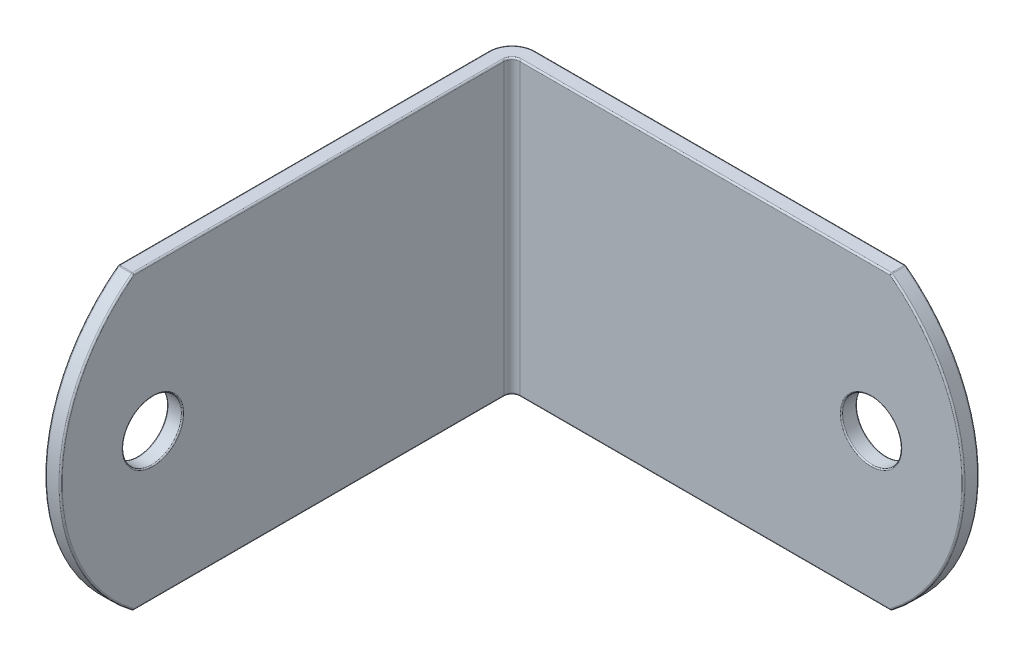
ISO-10303-21;
HEADER;
FILE_DESCRIPTION(('STEP AP214'),'2;1');
FILE_NAME('part.step','',(''),(''),'','','');
FILE_SCHEMA(('AUTOMOTIVE_DESIGN { 1 0 10303 214 1 1 1 1 }'));
ENDSEC;
DATA;
#1=APPLICATION_CONTEXT('core data for automotive mechanical design processes');
#2=APPLICATION_PROTOCOL_DEFINITION('international standard','automotive_design',2000,#1);
#3=PRODUCT_CONTEXT('',#1,'mechanical');
#4=PRODUCT('Part','Part','',(#3));
#5=PRODUCT_RELATED_PRODUCT_CATEGORY('part','',(#4));
#6=PRODUCT_DEFINITION_FORMATION('','',#4);
#7=PRODUCT_DEFINITION_CONTEXT('part definition',#1,'design');
#8=PRODUCT_DEFINITION('design','',#6,#7);
#9=PRODUCT_DEFINITION_SHAPE('','',#8);
#10=(LENGTH_UNIT() NAMED_UNIT(*) SI_UNIT(.MILLI.,.METRE.));
#11=(NAMED_UNIT(*) PLANE_ANGLE_UNIT() SI_UNIT($,.RADIAN.));
#12=(NAMED_UNIT(*) SI_UNIT($,.STERADIAN.) SOLID_ANGLE_UNIT());
#13=UNCERTAINTY_MEASURE_WITH_UNIT(LENGTH_MEASURE(1.E-05),#10,'distance_accuracy_value','');
#14=(GEOMETRIC_REPRESENTATION_CONTEXT(3) GLOBAL_UNCERTAINTY_ASSIGNED_CONTEXT((#13)) GLOBAL_UNIT_ASSIGNED_CONTEXT((#10,
#11,#12)) REPRESENTATION_CONTEXT('',''));
#15=CARTESIAN_POINT('',(0.,0.,0.));
#16=DIRECTION('',(0.,0.,1.));
#17=DIRECTION('',(1.,0.,0.));
#18=AXIS2_PLACEMENT_3D('',#15,#16,#17);
#19=CARTESIAN_POINT('',(-17.145,-11.90625,-19.05));
#20=DIRECTION('',(0.,0.,-1.));
#21=DIRECTION('',(-1.,0.,0.));
#22=AXIS2_PLACEMENT_3D('',#19,#20,#21);
#23=PLANE('',#22);
#24=CARTESIAN_POINT('',(11.509375,0.,-19.05));
#25=DIRECTION('',(0.,0.,-1.));
#26=DIRECTION('',(-1.,0.,0.));
#27=AXIS2_PLACEMENT_3D('',#24,#25,#26);
#28=CIRCLE('',#27,2.50952);
#29=CARTESIAN_POINT('',(8.999855,0.,-19.05));
#30=VERTEX_POINT('',#29);
#31=EDGE_CURVE('E374',#30,#30,#28,.F.);
#32=ORIENTED_EDGE('',*,*,#31,.T.);
#33=EDGE_LOOP('',(#32));
#34=FACE_BOUND('',#33,.T.);
#35=CARTESIAN_POINT('',(4.1671875,0.,-19.05));
#36=DIRECTION('',(0.,0.,-1.));
#37=DIRECTION('',(-1.,0.,0.));
#38=AXIS2_PLACEMENT_3D('',#35,#36,#37);
#39=CIRCLE('',#38,14.7558125);
#40=CARTESIAN_POINT('',(13.0544408424369,11.77925,-19.05));
#41=VERTEX_POINT('',#40);
#42=CARTESIAN_POINT('',(13.0544408424369,-11.77925,-19.05));
#43=VERTEX_POINT('',#42);
#44=EDGE_CURVE('E273',#41,#43,#39,.T.);
#45=ORIENTED_EDGE('',*,*,#44,.T.);
#46=DIRECTION('',(-1.,0.,0.));
#47=VECTOR('',#46,1.);
#48=CARTESIAN_POINT('',(-17.145,-11.77925,-19.05));
#49=LINE('',#48,#47);
#50=CARTESIAN_POINT('',(-17.145,-11.77925,-19.05));
#51=VERTEX_POINT('',#50);
#52=EDGE_CURVE('E277',#43,#51,#49,.T.);
#53=ORIENTED_EDGE('',*,*,#52,.T.);
#54=DIRECTION('',(0.,1.,0.));
#55=VECTOR('',#54,1.);
#56=CARTESIAN_POINT('',(-17.145,-11.90625,-19.05));
#57=LINE('',#56,#55);
#58=CARTESIAN_POINT('',(-17.145,11.77925,-19.05));
#59=VERTEX_POINT('',#58);
#60=EDGE_CURVE('E178',#51,#59,#57,.T.);
#61=ORIENTED_EDGE('',*,*,#60,.T.);
#62=DIRECTION('',(-1.,0.,0.));
#63=VECTOR('',#62,1.);
#64=CARTESIAN_POINT('',(-17.145,11.77925,-19.05));
#65=LINE('',#64,#63);
#66=EDGE_CURVE('E275',#59,#41,#65,.F.);
#67=ORIENTED_EDGE('',*,*,#66,.T.);
#68=EDGE_LOOP('',(#45,#53,#61,#67));
#69=FACE_BOUND('',#68,.T.);
#70=ADVANCED_FACE('F34',(#34,#69),#23,.T.);
#71=CARTESIAN_POINT('',(-17.145,-11.90625,-17.78));
#72=DIRECTION('',(0.,0.,1.));
#73=DIRECTION('',(1.,0.,0.));
#74=AXIS2_PLACEMENT_3D('',#71,#72,#73);
#75=PLANE('',#74);
#76=CARTESIAN_POINT('',(11.509375,0.,-17.78));
#77=DIRECTION('',(0.,0.,1.));
#78=DIRECTION('',(1.,0.,0.));
#79=AXIS2_PLACEMENT_3D('',#76,#77,#78);
#80=CIRCLE('',#79,2.50952);
#81=CARTESIAN_POINT('',(14.018895,0.,-17.78));
#82=VERTEX_POINT('',#81);
#83=EDGE_CURVE('E42',#82,#82,#80,.F.);
#84=ORIENTED_EDGE('',*,*,#83,.T.);
#85=EDGE_LOOP('',(#84));
#86=FACE_BOUND('',#85,.T.);
#87=DIRECTION('',(0.,1.,0.));
#88=VECTOR('',#87,1.);
#89=CARTESIAN_POINT('',(-17.145,-11.90625,-17.78));
#90=LINE('',#89,#88);
#91=CARTESIAN_POINT('',(-17.145,-11.77925,-17.78));
#92=VERTEX_POINT('',#91);
#93=CARTESIAN_POINT('',(-17.145,11.77925,-17.78));
#94=VERTEX_POINT('',#93);
#95=EDGE_CURVE('E618',#92,#94,#90,.T.);
#96=ORIENTED_EDGE('',*,*,#95,.F.);
#97=DIRECTION('',(1.,0.,0.));
#98=VECTOR('',#97,1.);
#99=CARTESIAN_POINT('',(13.096875,-11.77925,-17.78));
#100=LINE('',#99,#98);
#101=CARTESIAN_POINT('',(13.0544408424369,-11.77925,-17.78));
#102=VERTEX_POINT('',#101);
#103=EDGE_CURVE('E248',#92,#102,#100,.T.);
#104=ORIENTED_EDGE('',*,*,#103,.T.);
#105=CARTESIAN_POINT('',(4.1671875,0.,-17.78));
#106=DIRECTION('',(0.,0.,1.));
#107=DIRECTION('',(1.,0.,0.));
#108=AXIS2_PLACEMENT_3D('',#105,#106,#107);
#109=CIRCLE('',#108,14.7558125);
#110=CARTESIAN_POINT('',(13.0544408424369,11.77925,-17.78));
#111=VERTEX_POINT('',#110);
#112=EDGE_CURVE('E244',#102,#111,#109,.T.);
#113=ORIENTED_EDGE('',*,*,#112,.T.);
#114=DIRECTION('',(1.,0.,0.));
#115=VECTOR('',#114,1.);
#116=CARTESIAN_POINT('',(-17.145,11.77925,-17.78));
#117=LINE('',#116,#115);
#118=EDGE_CURVE('E246',#111,#94,#117,.F.);
#119=ORIENTED_EDGE('',*,*,#118,.T.);
#120=EDGE_LOOP('',(#96,#104,#113,#119));
#121=FACE_BOUND('',#120,.T.);
#122=ADVANCED_FACE('F388',(#86,#121),#75,.T.);
#123=CARTESIAN_POINT('',(-19.05,-11.90625,19.05));
#124=DIRECTION('',(-1.,0.,0.));
#125=DIRECTION('',(0.,0.,1.));
#126=AXIS2_PLACEMENT_3D('',#123,#124,#125);
#127=PLANE('',#126);
#128=CARTESIAN_POINT('',(-19.05,0.,11.509375));
#129=DIRECTION('',(-1.,0.,0.));
#130=DIRECTION('',(0.,0.,1.));
#131=AXIS2_PLACEMENT_3D('',#128,#129,#130);
#132=CIRCLE('',#131,2.50952);
#133=CARTESIAN_POINT('',(-19.05,0.,14.018895));
#134=VERTEX_POINT('',#133);
#135=EDGE_CURVE('E383',#134,#134,#132,.F.);
#136=ORIENTED_EDGE('',*,*,#135,.T.);
#137=EDGE_LOOP('',(#136));
#138=FACE_BOUND('',#137,.T.);
#139=DIRECTION('',(0.,1.,0.));
#140=VECTOR('',#139,1.);
#141=CARTESIAN_POINT('',(-19.05,-11.90625,-17.145));
#142=LINE('',#141,#140);
#143=CARTESIAN_POINT('',(-19.05,-11.77925,-17.145));
#144=VERTEX_POINT('',#143);
#145=CARTESIAN_POINT('',(-19.05,11.77925,-17.145));
#146=VERTEX_POINT('',#145);
#147=EDGE_CURVE('E175',#144,#146,#142,.T.);
#148=ORIENTED_EDGE('',*,*,#147,.F.);
#149=DIRECTION('',(0.,0.,1.));
#150=VECTOR('',#149,1.);
#151=CARTESIAN_POINT('',(-19.05,-11.77925,13.096875));
#152=LINE('',#151,#150);
#153=CARTESIAN_POINT('',(-19.05,-11.77925,13.0544408424369));
#154=VERTEX_POINT('',#153);
#155=EDGE_CURVE('E190',#144,#154,#152,.T.);
#156=ORIENTED_EDGE('',*,*,#155,.T.);
#157=CARTESIAN_POINT('',(-19.05,0.,4.1671875));
#158=DIRECTION('',(-1.,0.,0.));
#159=DIRECTION('',(0.,0.,1.));
#160=AXIS2_PLACEMENT_3D('',#157,#158,#159);
#161=CIRCLE('',#160,14.7558125);
#162=CARTESIAN_POINT('',(-19.05,11.77925,13.0544408424369));
#163=VERTEX_POINT('',#162);
#164=EDGE_CURVE('E193',#154,#163,#161,.T.);
#165=ORIENTED_EDGE('',*,*,#164,.T.);
#166=DIRECTION('',(0.,0.,1.));
#167=VECTOR('',#166,1.);
#168=CARTESIAN_POINT('',(-19.05,11.77925,19.05));
#169=LINE('',#168,#167);
#170=EDGE_CURVE('E192',#163,#146,#169,.F.);
#171=ORIENTED_EDGE('',*,*,#170,.T.);
#172=EDGE_LOOP('',(#148,#156,#165,#171));
#173=FACE_BOUND('',#172,.T.);
#174=ADVANCED_FACE('F188',(#138,#173),#127,.T.);
#175=CARTESIAN_POINT('',(-17.78,-11.90625,19.05));
#176=DIRECTION('',(1.,0.,0.));
#177=DIRECTION('',(0.,0.,-1.));
#178=AXIS2_PLACEMENT_3D('',#175,#176,#177);
#179=PLANE('',#178);
#180=CARTESIAN_POINT('',(-17.78,0.,11.509375));
#181=DIRECTION('',(1.,0.,0.));
#182=DIRECTION('',(0.,0.,-1.));
#183=AXIS2_PLACEMENT_3D('',#180,#181,#182);
#184=CIRCLE('',#183,2.50952);
#185=CARTESIAN_POINT('',(-17.78,0.,8.999855));
#186=VERTEX_POINT('',#185);
#187=EDGE_CURVE('E12',#186,#186,#184,.F.);
#188=ORIENTED_EDGE('',*,*,#187,.T.);
#189=EDGE_LOOP('',(#188));
#190=FACE_BOUND('',#189,.T.);
#191=CARTESIAN_POINT('',(-17.78,0.,4.1671875));
#192=DIRECTION('',(1.,0.,0.));
#193=DIRECTION('',(0.,0.,-1.));
#194=AXIS2_PLACEMENT_3D('',#191,#192,#193);
#195=CIRCLE('',#194,14.7558125);
#196=CARTESIAN_POINT('',(-17.78,11.77925,13.0544408424369));
#197=VERTEX_POINT('',#196);
#198=CARTESIAN_POINT('',(-17.78,-11.77925,13.0544408424369));
#199=VERTEX_POINT('',#198);
#200=EDGE_CURVE('E49',#197,#199,#195,.T.);
#201=ORIENTED_EDGE('',*,*,#200,.T.);
#202=DIRECTION('',(0.,0.,-1.));
#203=VECTOR('',#202,1.);
#204=CARTESIAN_POINT('',(-17.78,-11.77925,-17.145));
#205=LINE('',#204,#203);
#206=CARTESIAN_POINT('',(-17.78,-11.77925,-17.145));
#207=VERTEX_POINT('',#206);
#208=EDGE_CURVE('E281',#199,#207,#205,.T.);
#209=ORIENTED_EDGE('',*,*,#208,.T.);
#210=DIRECTION('',(0.,1.,0.));
#211=VECTOR('',#210,1.);
#212=CARTESIAN_POINT('',(-17.78,-11.90625,-17.145));
#213=LINE('',#212,#211);
#214=CARTESIAN_POINT('',(-17.78,11.77925,-17.145));
#215=VERTEX_POINT('',#214);
#216=EDGE_CURVE('E368',#207,#215,#213,.T.);
#217=ORIENTED_EDGE('',*,*,#216,.T.);
#218=DIRECTION('',(0.,0.,-1.));
#219=VECTOR('',#218,1.);
#220=CARTESIAN_POINT('',(-17.78,11.77925,19.05));
#221=LINE('',#220,#219);
#222=EDGE_CURVE('E54',#215,#197,#221,.F.);
#223=ORIENTED_EDGE('',*,*,#222,.T.);
#224=EDGE_LOOP('',(#201,#209,#217,#223));
#225=FACE_BOUND('',#224,.T.);
#226=ADVANCED_FACE('F420',(#190,#225),#179,.T.);
#227=CARTESIAN_POINT('',(-17.145,-11.90625,-17.145));
#228=DIRECTION('',(0.,1.,0.));
#229=DIRECTION('',(0.,0.,1.));
#230=AXIS2_PLACEMENT_3D('',#227,#228,#229);
#231=PLANE('',#230);
#232=CARTESIAN_POINT('',(-17.145,-11.90625,-17.145));
#233=DIRECTION('',(0.,1.,0.));
#234=DIRECTION('',(0.,0.,1.));
#235=AXIS2_PLACEMENT_3D('',#232,#233,#234);
#236=CIRCLE('',#235,1.778);
#237=CARTESIAN_POINT('',(-18.923,-11.90625,-17.145));
#238=VERTEX_POINT('',#237);
#239=CARTESIAN_POINT('',(-17.145,-11.90625,-18.923));
#240=VERTEX_POINT('',#239);
#241=EDGE_CURVE('E198',#238,#240,#236,.F.);
#242=ORIENTED_EDGE('',*,*,#241,.T.);
#243=DIRECTION('',(-1.,0.,0.));
#244=VECTOR('',#243,1.);
#245=CARTESIAN_POINT('',(13.096875,-11.90625,-18.923));
#246=LINE('',#245,#244);
#247=CARTESIAN_POINT('',(13.0544408424369,-11.90625,-18.923));
#248=VERTEX_POINT('',#247);
#249=EDGE_CURVE('E225',#240,#248,#246,.F.);
#250=ORIENTED_EDGE('',*,*,#249,.T.);
#251=DIRECTION('',(0.,0.,1.));
#252=VECTOR('',#251,1.);
#253=CARTESIAN_POINT('',(13.0544408424369,-11.90625,-17.145));
#254=LINE('',#253,#252);
#255=CARTESIAN_POINT('',(13.0544408424369,-11.90625,-17.907));
#256=VERTEX_POINT('',#255);
#257=EDGE_CURVE('E222',#248,#256,#254,.T.);
#258=ORIENTED_EDGE('',*,*,#257,.T.);
#259=DIRECTION('',(1.,0.,0.));
#260=VECTOR('',#259,1.);
#261=CARTESIAN_POINT('',(-17.145,-11.90625,-17.907));
#262=LINE('',#261,#260);
#263=CARTESIAN_POINT('',(-17.145,-11.90625,-17.907));
#264=VERTEX_POINT('',#263);
#265=EDGE_CURVE('E218',#256,#264,#262,.F.);
#266=ORIENTED_EDGE('',*,*,#265,.T.);
#267=CARTESIAN_POINT('',(-17.145,-11.90625,-17.145));
#268=DIRECTION('',(0.,1.,0.));
#269=DIRECTION('',(0.,0.,1.));
#270=AXIS2_PLACEMENT_3D('',#267,#268,#269);
#271=CIRCLE('',#270,0.762);
#272=CARTESIAN_POINT('',(-17.907,-11.90625,-17.145));
#273=VERTEX_POINT('',#272);
#274=EDGE_CURVE('E216',#264,#273,#271,.T.);
#275=ORIENTED_EDGE('',*,*,#274,.T.);
#276=DIRECTION('',(0.,0.,-1.));
#277=VECTOR('',#276,1.);
#278=CARTESIAN_POINT('',(-17.907,-11.90625,13.096875));
#279=LINE('',#278,#277);
#280=CARTESIAN_POINT('',(-17.907,-11.90625,13.0544408424369));
#281=VERTEX_POINT('',#280);
#282=EDGE_CURVE('E208',#273,#281,#279,.F.);
#283=ORIENTED_EDGE('',*,*,#282,.T.);
#284=DIRECTION('',(-1.,0.,0.));
#285=VECTOR('',#284,1.);
#286=CARTESIAN_POINT('',(-19.05,-11.90625,13.0544408424369));
#287=LINE('',#286,#285);
#288=CARTESIAN_POINT('',(-18.923,-11.90625,13.0544408424369));
#289=VERTEX_POINT('',#288);
#290=EDGE_CURVE('E210',#281,#289,#287,.T.);
#291=ORIENTED_EDGE('',*,*,#290,.T.);
#292=DIRECTION('',(0.,0.,1.));
#293=VECTOR('',#292,1.);
#294=CARTESIAN_POINT('',(-18.923,-11.90625,-17.145));
#295=LINE('',#294,#293);
#296=EDGE_CURVE('E220',#289,#238,#295,.F.);
#297=ORIENTED_EDGE('',*,*,#296,.T.);
#298=EDGE_LOOP('',(#242,#250,#258,#266,#275,#283,#291,#297));
#299=FACE_BOUND('',#298,.T.);
#300=ADVANCED_FACE('F423',(#299),#231,.F.);
#301=CARTESIAN_POINT('',(-17.145,11.90625,-17.145));
#302=DIRECTION('',(0.,1.,0.));
#303=DIRECTION('',(0.,0.,1.));
#304=AXIS2_PLACEMENT_3D('',#301,#302,#303);
#305=PLANE('',#304);
#306=DIRECTION('',(0.,0.,-1.));
#307=VECTOR('',#306,1.);
#308=CARTESIAN_POINT('',(13.0544408424369,11.90625,-19.05));
#309=LINE('',#308,#307);
#310=CARTESIAN_POINT('',(13.0544408424369,11.90625,-17.907));
#311=VERTEX_POINT('',#310);
#312=CARTESIAN_POINT('',(13.0544408424369,11.90625,-18.923));
#313=VERTEX_POINT('',#312);
#314=EDGE_CURVE('E238',#311,#313,#309,.T.);
#315=ORIENTED_EDGE('',*,*,#314,.T.);
#316=DIRECTION('',(-1.,0.,0.));
#317=VECTOR('',#316,1.);
#318=CARTESIAN_POINT('',(-17.145,11.90625,-18.923));
#319=LINE('',#318,#317);
#320=CARTESIAN_POINT('',(-17.145,11.90625,-18.923));
#321=VERTEX_POINT('',#320);
#322=EDGE_CURVE('E242',#313,#321,#319,.T.);
#323=ORIENTED_EDGE('',*,*,#322,.T.);
#324=CARTESIAN_POINT('',(-17.145,11.90625,-17.145));
#325=DIRECTION('',(0.,1.,0.));
#326=DIRECTION('',(0.,0.,1.));
#327=AXIS2_PLACEMENT_3D('',#324,#325,#326);
#328=CIRCLE('',#327,1.778);
#329=CARTESIAN_POINT('',(-18.923,11.90625,-17.145));
#330=VERTEX_POINT('',#329);
#331=EDGE_CURVE('E240',#321,#330,#328,.T.);
#332=ORIENTED_EDGE('',*,*,#331,.T.);
#333=DIRECTION('',(0.,0.,1.));
#334=VECTOR('',#333,1.);
#335=CARTESIAN_POINT('',(-18.923,11.90625,-17.145));
#336=LINE('',#335,#334);
#337=CARTESIAN_POINT('',(-18.923,11.90625,13.0544408424369));
#338=VERTEX_POINT('',#337);
#339=EDGE_CURVE('E235',#330,#338,#336,.T.);
#340=ORIENTED_EDGE('',*,*,#339,.T.);
#341=DIRECTION('',(1.,0.,0.));
#342=VECTOR('',#341,1.);
#343=CARTESIAN_POINT('',(-17.145,11.90625,13.0544408424369));
#344=LINE('',#343,#342);
#345=CARTESIAN_POINT('',(-17.907,11.90625,13.0544408424369));
#346=VERTEX_POINT('',#345);
#347=EDGE_CURVE('E229',#338,#346,#344,.T.);
#348=ORIENTED_EDGE('',*,*,#347,.T.);
#349=DIRECTION('',(0.,0.,-1.));
#350=VECTOR('',#349,1.);
#351=CARTESIAN_POINT('',(-17.907,11.90625,-17.145));
#352=LINE('',#351,#350);
#353=CARTESIAN_POINT('',(-17.907,11.90625,-17.145));
#354=VERTEX_POINT('',#353);
#355=EDGE_CURVE('E183',#346,#354,#352,.T.);
#356=ORIENTED_EDGE('',*,*,#355,.T.);
#357=CARTESIAN_POINT('',(-17.145,11.90625,-17.145));
#358=DIRECTION('',(0.,1.,0.));
#359=DIRECTION('',(0.,0.,1.));
#360=AXIS2_PLACEMENT_3D('',#357,#358,#359);
#361=CIRCLE('',#360,0.762);
#362=CARTESIAN_POINT('',(-17.145,11.90625,-17.907));
#363=VERTEX_POINT('',#362);
#364=EDGE_CURVE('E231',#354,#363,#361,.F.);
#365=ORIENTED_EDGE('',*,*,#364,.T.);
#366=DIRECTION('',(1.,0.,0.));
#367=VECTOR('',#366,1.);
#368=CARTESIAN_POINT('',(-17.145,11.90625,-17.907));
#369=LINE('',#368,#367);
#370=EDGE_CURVE('E233',#363,#311,#369,.T.);
#371=ORIENTED_EDGE('',*,*,#370,.T.);
#372=EDGE_LOOP('',(#315,#323,#332,#340,#348,#356,#365,#371));
#373=FACE_BOUND('',#372,.T.);
#374=ADVANCED_FACE('F561',(#373),#305,.T.);
#375=CARTESIAN_POINT('',(-17.145,-11.90625,-17.145));
#376=DIRECTION('',(0.,1.,0.));
#377=DIRECTION('',(0.,0.,1.));
#378=AXIS2_PLACEMENT_3D('',#375,#376,#377);
#379=CYLINDRICAL_SURFACE('',#378,1.905);
#380=ORIENTED_EDGE('',*,*,#60,.F.);
#381=CARTESIAN_POINT('',(-17.145,-11.77925,-17.145));
#382=DIRECTION('',(0.,1.,0.));
#383=DIRECTION('',(0.,0.,1.));
#384=AXIS2_PLACEMENT_3D('',#381,#382,#383);
#385=CIRCLE('',#384,1.905);
#386=EDGE_CURVE('E172',#51,#144,#385,.T.);
#387=ORIENTED_EDGE('',*,*,#386,.T.);
#388=ORIENTED_EDGE('',*,*,#147,.T.);
#389=CARTESIAN_POINT('',(-17.145,11.77925,-17.145));
#390=DIRECTION('',(0.,1.,0.));
#391=DIRECTION('',(0.,0.,1.));
#392=AXIS2_PLACEMENT_3D('',#389,#390,#391);
#393=CIRCLE('',#392,1.905);
#394=EDGE_CURVE('E184',#146,#59,#393,.F.);
#395=ORIENTED_EDGE('',*,*,#394,.T.);
#396=EDGE_LOOP('',(#380,#387,#388,#395));
#397=FACE_BOUND('',#396,.T.);
#398=ADVANCED_FACE('F174',(#397),#379,.T.);
#399=CARTESIAN_POINT('',(-17.145,-11.90625,-17.145));
#400=DIRECTION('',(0.,1.,0.));
#401=DIRECTION('',(0.,0.,1.));
#402=AXIS2_PLACEMENT_3D('',#399,#400,#401);
#403=CYLINDRICAL_SURFACE('',#402,0.635);
#404=ORIENTED_EDGE('',*,*,#216,.F.);
#405=CARTESIAN_POINT('',(-17.145,-11.77925,-17.145));
#406=DIRECTION('',(0.,1.,0.));
#407=DIRECTION('',(0.,0.,1.));
#408=AXIS2_PLACEMENT_3D('',#405,#406,#407);
#409=CIRCLE('',#408,0.635);
#410=EDGE_CURVE('E253',#207,#92,#409,.F.);
#411=ORIENTED_EDGE('',*,*,#410,.T.);
#412=ORIENTED_EDGE('',*,*,#95,.T.);
#413=CARTESIAN_POINT('',(-17.145,11.77925,-17.145));
#414=DIRECTION('',(0.,1.,0.));
#415=DIRECTION('',(0.,0.,1.));
#416=AXIS2_PLACEMENT_3D('',#413,#414,#415);
#417=CIRCLE('',#416,0.635);
#418=EDGE_CURVE('E251',#94,#215,#417,.T.);
#419=ORIENTED_EDGE('',*,*,#418,.T.);
#420=EDGE_LOOP('',(#404,#411,#412,#419));
#421=FACE_BOUND('',#420,.T.);
#422=ADVANCED_FACE('F415',(#421),#403,.F.);
#423=CARTESIAN_POINT('',(-19.05,0.,11.509375));
#424=DIRECTION('',(-1.,0.,0.));
#425=DIRECTION('',(0.,0.,1.));
#426=AXIS2_PLACEMENT_3D('',#423,#424,#425);
#427=CYLINDRICAL_SURFACE('',#426,2.413);
#428=CARTESIAN_POINT('',(-18.95348,0.,11.509375));
#429=DIRECTION('',(-1.,0.,0.));
#430=DIRECTION('',(0.,0.,1.));
#431=AXIS2_PLACEMENT_3D('',#428,#429,#430);
#432=CIRCLE('',#431,2.413);
#433=CARTESIAN_POINT('',(-18.95348,0.,13.922375));
#434=VERTEX_POINT('',#433);
#435=EDGE_CURVE('E380',#434,#434,#432,.T.);
#436=ORIENTED_EDGE('',*,*,#435,.T.);
#437=EDGE_LOOP('',(#436));
#438=FACE_BOUND('',#437,.T.);
#439=CARTESIAN_POINT('',(-17.87652,0.,11.509375));
#440=DIRECTION('',(1.,0.,0.));
#441=DIRECTION('',(0.,0.,-1.));
#442=AXIS2_PLACEMENT_3D('',#439,#440,#441);
#443=CIRCLE('',#442,2.413);
#444=CARTESIAN_POINT('',(-17.87652,0.,9.096375));
#445=VERTEX_POINT('',#444);
#446=EDGE_CURVE('E377',#445,#445,#443,.T.);
#447=ORIENTED_EDGE('',*,*,#446,.T.);
#448=EDGE_LOOP('',(#447));
#449=FACE_BOUND('',#448,.T.);
#450=ADVANCED_FACE('F418',(#438,#449),#427,.F.);
#451=CARTESIAN_POINT('',(11.509375,0.,-19.05));
#452=DIRECTION('',(0.,0.,-1.));
#453=DIRECTION('',(-1.,0.,0.));
#454=AXIS2_PLACEMENT_3D('',#451,#452,#453);
#455=CYLINDRICAL_SURFACE('',#454,2.413);
#456=CARTESIAN_POINT('',(11.509375,0.,-18.95348));
#457=DIRECTION('',(0.,0.,-1.));
#458=DIRECTION('',(-1.,0.,0.));
#459=AXIS2_PLACEMENT_3D('',#456,#457,#458);
#460=CIRCLE('',#459,2.413);
#461=CARTESIAN_POINT('',(9.096375,0.,-18.95348));
#462=VERTEX_POINT('',#461);
#463=EDGE_CURVE('E371',#462,#462,#460,.T.);
#464=ORIENTED_EDGE('',*,*,#463,.T.);
#465=EDGE_LOOP('',(#464));
#466=FACE_BOUND('',#465,.T.);
#467=CARTESIAN_POINT('',(11.509375,0.,-17.87652));
#468=DIRECTION('',(0.,0.,1.));
#469=DIRECTION('',(1.,0.,0.));
#470=AXIS2_PLACEMENT_3D('',#467,#468,#469);
#471=CIRCLE('',#470,2.413);
#472=CARTESIAN_POINT('',(13.922375,0.,-17.87652));
#473=VERTEX_POINT('',#472);
#474=EDGE_CURVE('E283',#473,#473,#471,.T.);
#475=ORIENTED_EDGE('',*,*,#474,.T.);
#476=EDGE_LOOP('',(#475));
#477=FACE_BOUND('',#476,.T.);
#478=ADVANCED_FACE('F545',(#466,#477),#455,.F.);
#479=CARTESIAN_POINT('',(-19.05,0.,4.1671875));
#480=DIRECTION('',(1.,0.,0.));
#481=DIRECTION('',(0.,0.,-1.));
#482=AXIS2_PLACEMENT_3D('',#479,#480,#481);
#483=CYLINDRICAL_SURFACE('',#482,14.8828125);
#484=DIRECTION('',(1.,0.,0.));
#485=VECTOR('',#484,1.);
#486=CARTESIAN_POINT('',(-19.05,11.8806313878429,13.1309314575413));
#487=LINE('',#486,#485);
#488=CARTESIAN_POINT('',(-17.907,11.8806313878429,13.1309314575413));
#489=VERTEX_POINT('',#488);
#490=CARTESIAN_POINT('',(-18.923,11.8806313878429,13.1309314575413));
#491=VERTEX_POINT('',#490);
#492=EDGE_CURVE('E257',#489,#491,#487,.F.);
#493=ORIENTED_EDGE('',*,*,#492,.T.);
#494=CARTESIAN_POINT('',(-18.923,0.,4.1671875));
#495=DIRECTION('',(-1.,0.,0.));
#496=DIRECTION('',(0.,0.,1.));
#497=AXIS2_PLACEMENT_3D('',#494,#495,#496);
#498=CIRCLE('',#497,14.8828125);
#499=CARTESIAN_POINT('',(-18.923,-11.8806313878429,13.1309314575413));
#500=VERTEX_POINT('',#499);
#501=EDGE_CURVE('E262',#491,#500,#498,.F.);
#502=ORIENTED_EDGE('',*,*,#501,.T.);
#503=DIRECTION('',(1.,0.,0.));
#504=VECTOR('',#503,1.);
#505=CARTESIAN_POINT('',(-19.05,-11.8806313878429,13.1309314575413));
#506=LINE('',#505,#504);
#507=CARTESIAN_POINT('',(-17.907,-11.8806313878429,13.1309314575413));
#508=VERTEX_POINT('',#507);
#509=EDGE_CURVE('E259',#500,#508,#506,.T.);
#510=ORIENTED_EDGE('',*,*,#509,.T.);
#511=CARTESIAN_POINT('',(-17.907,0.,4.1671875));
#512=DIRECTION('',(1.,0.,0.));
#513=DIRECTION('',(0.,0.,-1.));
#514=AXIS2_PLACEMENT_3D('',#511,#512,#513);
#515=CIRCLE('',#514,14.8828125);
#516=EDGE_CURVE('E255',#508,#489,#515,.F.);
#517=ORIENTED_EDGE('',*,*,#516,.T.);
#518=EDGE_LOOP('',(#493,#502,#510,#517));
#519=FACE_BOUND('',#518,.T.);
#520=ADVANCED_FACE('F548',(#519),#483,.T.);
#521=CARTESIAN_POINT('',(4.1671875,0.,-19.05));
#522=DIRECTION('',(0.,0.,1.));
#523=DIRECTION('',(1.,0.,0.));
#524=AXIS2_PLACEMENT_3D('',#521,#522,#523);
#525=CYLINDRICAL_SURFACE('',#524,14.8828125);
#526=DIRECTION('',(0.,0.,1.));
#527=VECTOR('',#526,1.);
#528=CARTESIAN_POINT('',(13.1309314575413,-11.8806313878429,-19.05));
#529=LINE('',#528,#527);
#530=CARTESIAN_POINT('',(13.1309314575413,-11.8806313878429,-17.907));
#531=VERTEX_POINT('',#530);
#532=CARTESIAN_POINT('',(13.1309314575413,-11.8806313878429,-18.923));
#533=VERTEX_POINT('',#532);
#534=EDGE_CURVE('E268',#531,#533,#529,.F.);
#535=ORIENTED_EDGE('',*,*,#534,.T.);
#536=CARTESIAN_POINT('',(4.1671875,0.,-18.923));
#537=DIRECTION('',(0.,0.,-1.));
#538=DIRECTION('',(-1.,0.,0.));
#539=AXIS2_PLACEMENT_3D('',#536,#537,#538);
#540=CIRCLE('',#539,14.8828125);
#541=CARTESIAN_POINT('',(13.1309314575413,11.8806313878429,-18.923));
#542=VERTEX_POINT('',#541);
#543=EDGE_CURVE('E271',#533,#542,#540,.F.);
#544=ORIENTED_EDGE('',*,*,#543,.T.);
#545=DIRECTION('',(0.,0.,1.));
#546=VECTOR('',#545,1.);
#547=CARTESIAN_POINT('',(13.1309314575413,11.8806313878429,-19.05));
#548=LINE('',#547,#546);
#549=CARTESIAN_POINT('',(13.1309314575413,11.8806313878429,-17.907));
#550=VERTEX_POINT('',#549);
#551=EDGE_CURVE('E266',#542,#550,#548,.T.);
#552=ORIENTED_EDGE('',*,*,#551,.T.);
#553=CARTESIAN_POINT('',(4.1671875,0.,-17.907));
#554=DIRECTION('',(0.,0.,1.));
#555=DIRECTION('',(1.,0.,0.));
#556=AXIS2_PLACEMENT_3D('',#553,#554,#555);
#557=CIRCLE('',#556,14.8828125);
#558=EDGE_CURVE('E264',#550,#531,#557,.F.);
#559=ORIENTED_EDGE('',*,*,#558,.T.);
#560=EDGE_LOOP('',(#535,#544,#552,#559));
#561=FACE_BOUND('',#560,.T.);
#562=ADVANCED_FACE('F535',(#561),#525,.T.);
#563=CARTESIAN_POINT('',(-17.145,11.77925,-17.907));
#564=DIRECTION('',(1.,0.,0.));
#565=DIRECTION('',(0.,0.,-1.));
#566=AXIS2_PLACEMENT_3D('',#563,#564,#565);
#567=CYLINDRICAL_SURFACE('',#566,0.127);
#568=CARTESIAN_POINT('',(13.0544408424369,11.77925,-17.907));
#569=DIRECTION('',(1.,0.,0.));
#570=DIRECTION('',(0.,0.,-1.));
#571=AXIS2_PLACEMENT_3D('',#568,#569,#570);
#572=CIRCLE('',#571,0.127);
#573=EDGE_CURVE('E365',#311,#111,#572,.T.);
#574=ORIENTED_EDGE('',*,*,#573,.F.);
#575=ORIENTED_EDGE('',*,*,#370,.F.);
#576=CARTESIAN_POINT('',(-17.145,11.77925,-17.907));
#577=DIRECTION('',(-1.,0.,0.));
#578=DIRECTION('',(0.,0.,1.));
#579=AXIS2_PLACEMENT_3D('',#576,#577,#578);
#580=CIRCLE('',#579,0.127);
#581=EDGE_CURVE('E362',#94,#363,#580,.T.);
#582=ORIENTED_EDGE('',*,*,#581,.F.);
#583=ORIENTED_EDGE('',*,*,#118,.F.);
#584=EDGE_LOOP('',(#574,#575,#582,#583));
#585=FACE_BOUND('',#584,.T.);
#586=ADVANCED_FACE('F531',(#585),#567,.T.);
#587=CARTESIAN_POINT('',(13.0544408424369,11.77925,-17.907));
#588=DIRECTION('',(0.,0.,1.));
#589=DIRECTION('',(1.,0.,0.));
#590=AXIS2_PLACEMENT_3D('',#587,#588,#589);
#591=SPHERICAL_SURFACE('',#590,0.127);
#592=CARTESIAN_POINT('',(13.0544408424369,11.77925,-17.907));
#593=DIRECTION('',(0.,0.,1.));
#594=DIRECTION('',(1.,0.,0.));
#595=AXIS2_PLACEMENT_3D('',#592,#593,#594);
#596=CIRCLE('',#595,0.127);
#597=EDGE_CURVE('E356',#311,#550,#596,.F.);
#598=ORIENTED_EDGE('',*,*,#597,.F.);
#599=ORIENTED_EDGE('',*,*,#573,.T.);
#600=CARTESIAN_POINT('',(13.0544408424369,11.77925,-17.907));
#601=DIRECTION('',(-0.798278644432497,0.602288307908277,0.));
#602=DIRECTION('',(-0.602288307908277,-0.798278644432497,0.));
#603=AXIS2_PLACEMENT_3D('',#600,#601,#602);
#604=CIRCLE('',#603,0.127);
#605=EDGE_CURVE('E359',#550,#111,#604,.F.);
#606=ORIENTED_EDGE('',*,*,#605,.F.);
#607=EDGE_LOOP('',(#598,#599,#606));
#608=FACE_BOUND('',#607,.T.);
#609=ADVANCED_FACE('F527',(#608),#591,.T.);
#610=CARTESIAN_POINT('',(-17.145,11.77925,-17.145));
#611=DIRECTION('',(0.,1.,0.));
#612=DIRECTION('',(0.,0.,1.));
#613=AXIS2_PLACEMENT_3D('',#610,#611,#612);
#614=TOROIDAL_SURFACE('',#613,0.762,0.127);
#615=ORIENTED_EDGE('',*,*,#581,.T.);
#616=ORIENTED_EDGE('',*,*,#364,.F.);
#617=CARTESIAN_POINT('',(-17.907,11.77925,-17.145));
#618=DIRECTION('',(0.,0.,1.));
#619=DIRECTION('',(1.,0.,0.));
#620=AXIS2_PLACEMENT_3D('',#617,#618,#619);
#621=CIRCLE('',#620,0.127);
#622=EDGE_CURVE('E353',#215,#354,#621,.T.);
#623=ORIENTED_EDGE('',*,*,#622,.F.);
#624=ORIENTED_EDGE('',*,*,#418,.F.);
#625=EDGE_LOOP('',(#615,#616,#623,#624));
#626=FACE_BOUND('',#625,.T.);
#627=ADVANCED_FACE('F523',(#626),#614,.T.);
#628=CARTESIAN_POINT('',(4.1671875,0.,-17.907));
#629=DIRECTION('',(0.,0.,1.));
#630=DIRECTION('',(1.,0.,0.));
#631=AXIS2_PLACEMENT_3D('',#628,#629,#630);
#632=TOROIDAL_SURFACE('',#631,14.7558125,0.127);
#633=ORIENTED_EDGE('',*,*,#605,.T.);
#634=ORIENTED_EDGE('',*,*,#112,.F.);
#635=CARTESIAN_POINT('',(13.0544408424369,-11.77925,-17.907));
#636=DIRECTION('',(-0.798278644432485,-0.602288307908293,0.));
#637=DIRECTION('',(0.602288307908293,-0.798278644432485,0.));
#638=AXIS2_PLACEMENT_3D('',#635,#636,#637);
#639=CIRCLE('',#638,0.127);
#640=EDGE_CURVE('E348',#531,#102,#639,.T.);
#641=ORIENTED_EDGE('',*,*,#640,.F.);
#642=ORIENTED_EDGE('',*,*,#558,.F.);
#643=EDGE_LOOP('',(#633,#634,#641,#642));
#644=FACE_BOUND('',#643,.T.);
#645=ADVANCED_FACE('F519',(#644),#632,.T.);
#646=CARTESIAN_POINT('',(13.0544408424369,11.77925,-19.05));
#647=DIRECTION('',(0.,0.,1.));
#648=DIRECTION('',(1.,0.,0.));
#649=AXIS2_PLACEMENT_3D('',#646,#647,#648);
#650=CYLINDRICAL_SURFACE('',#649,0.127);
#651=ORIENTED_EDGE('',*,*,#597,.T.);
#652=ORIENTED_EDGE('',*,*,#551,.F.);
#653=CARTESIAN_POINT('',(13.0544408424369,11.77925,-18.923));
#654=DIRECTION('',(0.,0.,-1.));
#655=DIRECTION('',(-1.,0.,0.));
#656=AXIS2_PLACEMENT_3D('',#653,#654,#655);
#657=CIRCLE('',#656,0.127);
#658=EDGE_CURVE('E345',#313,#542,#657,.T.);
#659=ORIENTED_EDGE('',*,*,#658,.F.);
#660=ORIENTED_EDGE('',*,*,#314,.F.);
#661=EDGE_LOOP('',(#651,#652,#659,#660));
#662=FACE_BOUND('',#661,.T.);
#663=ADVANCED_FACE('F515',(#662),#650,.T.);
#664=CARTESIAN_POINT('',(-17.145,11.77925,-18.923));
#665=DIRECTION('',(-1.,0.,0.));
#666=DIRECTION('',(0.,0.,1.));
#667=AXIS2_PLACEMENT_3D('',#664,#665,#666);
#668=CYLINDRICAL_SURFACE('',#667,0.127);
#669=CARTESIAN_POINT('',(-17.145,11.77925,-18.923));
#670=DIRECTION('',(-1.,0.,0.));
#671=DIRECTION('',(0.,0.,1.));
#672=AXIS2_PLACEMENT_3D('',#669,#670,#671);
#673=CIRCLE('',#672,0.127);
#674=EDGE_CURVE('E339',#321,#59,#673,.T.);
#675=ORIENTED_EDGE('',*,*,#674,.F.);
#676=ORIENTED_EDGE('',*,*,#322,.F.);
#677=CARTESIAN_POINT('',(13.0544408424369,11.77925,-18.923));
#678=DIRECTION('',(1.,0.,0.));
#679=DIRECTION('',(0.,0.,-1.));
#680=AXIS2_PLACEMENT_3D('',#677,#678,#679);
#681=CIRCLE('',#680,0.127);
#682=EDGE_CURVE('E342',#41,#313,#681,.T.);
#683=ORIENTED_EDGE('',*,*,#682,.F.);
#684=ORIENTED_EDGE('',*,*,#66,.F.);
#685=EDGE_LOOP('',(#675,#676,#683,#684));
#686=FACE_BOUND('',#685,.T.);
#687=ADVANCED_FACE('F511',(#686),#668,.T.);
#688=CARTESIAN_POINT('',(-17.907,11.77925,-17.145));
#689=DIRECTION('',(0.,0.,-1.));
#690=DIRECTION('',(-1.,0.,0.));
#691=AXIS2_PLACEMENT_3D('',#688,#689,#690);
#692=CYLINDRICAL_SURFACE('',#691,0.127);
#693=ORIENTED_EDGE('',*,*,#622,.T.);
#694=ORIENTED_EDGE('',*,*,#355,.F.);
#695=CARTESIAN_POINT('',(-17.907,11.77925,13.0544408424369));
#696=DIRECTION('',(0.,0.,1.));
#697=DIRECTION('',(0.,-1.,0.));
#698=AXIS2_PLACEMENT_3D('',#695,#696,#697);
#699=CIRCLE('',#698,0.127);
#700=EDGE_CURVE('E336',#197,#346,#699,.T.);
#701=ORIENTED_EDGE('',*,*,#700,.F.);
#702=ORIENTED_EDGE('',*,*,#222,.F.);
#703=EDGE_LOOP('',(#693,#694,#701,#702));
#704=FACE_BOUND('',#703,.T.);
#705=ADVANCED_FACE('F507',(#704),#692,.T.);
#706=CARTESIAN_POINT('',(-17.145,-11.77925,-17.907));
#707=DIRECTION('',(-1.,0.,0.));
#708=DIRECTION('',(0.,0.,1.));
#709=AXIS2_PLACEMENT_3D('',#706,#707,#708);
#710=CYLINDRICAL_SURFACE('',#709,0.127);
#711=CARTESIAN_POINT('',(13.0544408424369,-11.77925,-17.907));
#712=DIRECTION('',(1.,0.,0.));
#713=DIRECTION('',(0.,0.,-1.));
#714=AXIS2_PLACEMENT_3D('',#711,#712,#713);
#715=CIRCLE('',#714,0.127);
#716=EDGE_CURVE('E350',#102,#256,#715,.T.);
#717=ORIENTED_EDGE('',*,*,#716,.F.);
#718=ORIENTED_EDGE('',*,*,#103,.F.);
#719=CARTESIAN_POINT('',(-17.145,-11.77925,-17.907));
#720=DIRECTION('',(-1.,0.,0.));
#721=DIRECTION('',(0.,0.,1.));
#722=AXIS2_PLACEMENT_3D('',#719,#720,#721);
#723=CIRCLE('',#722,0.127);
#724=EDGE_CURVE('E333',#264,#92,#723,.T.);
#725=ORIENTED_EDGE('',*,*,#724,.F.);
#726=ORIENTED_EDGE('',*,*,#265,.F.);
#727=EDGE_LOOP('',(#717,#718,#725,#726));
#728=FACE_BOUND('',#727,.T.);
#729=ADVANCED_FACE('F503',(#728),#710,.T.);
#730=CARTESIAN_POINT('',(13.0544408424369,-11.77925,-17.907));
#731=DIRECTION('',(0.,0.,1.));
#732=DIRECTION('',(1.,0.,0.));
#733=AXIS2_PLACEMENT_3D('',#730,#731,#732);
#734=SPHERICAL_SURFACE('',#733,0.127);
#735=ORIENTED_EDGE('',*,*,#640,.T.);
#736=ORIENTED_EDGE('',*,*,#716,.T.);
#737=CARTESIAN_POINT('',(13.0544408424369,-11.77925,-17.907));
#738=DIRECTION('',(0.,0.,1.));
#739=DIRECTION('',(1.,0.,0.));
#740=AXIS2_PLACEMENT_3D('',#737,#738,#739);
#741=CIRCLE('',#740,0.127);
#742=EDGE_CURVE('E330',#531,#256,#741,.F.);
#743=ORIENTED_EDGE('',*,*,#742,.F.);
#744=EDGE_LOOP('',(#735,#736,#743));
#745=FACE_BOUND('',#744,.T.);
#746=ADVANCED_FACE('F499',(#745),#734,.T.);
#747=CARTESIAN_POINT('',(13.0544408424369,11.77925,-18.923));
#748=DIRECTION('',(0.,0.,1.));
#749=DIRECTION('',(1.,0.,0.));
#750=AXIS2_PLACEMENT_3D('',#747,#748,#749);
#751=SPHERICAL_SURFACE('',#750,0.127);
#752=ORIENTED_EDGE('',*,*,#682,.T.);
#753=ORIENTED_EDGE('',*,*,#658,.T.);
#754=CARTESIAN_POINT('',(13.0544408424369,11.77925,-18.923));
#755=DIRECTION('',(-0.798278644432492,0.602288307908284,0.));
#756=DIRECTION('',(-0.602288307908284,-0.798278644432492,0.));
#757=AXIS2_PLACEMENT_3D('',#754,#755,#756);
#758=CIRCLE('',#757,0.127);
#759=EDGE_CURVE('E327',#41,#542,#758,.F.);
#760=ORIENTED_EDGE('',*,*,#759,.F.);
#761=EDGE_LOOP('',(#752,#753,#760));
#762=FACE_BOUND('',#761,.T.);
#763=ADVANCED_FACE('F495',(#762),#751,.T.);
#764=CARTESIAN_POINT('',(-17.145,11.77925,-17.145));
#765=DIRECTION('',(0.,1.,0.));
#766=DIRECTION('',(0.,0.,1.));
#767=AXIS2_PLACEMENT_3D('',#764,#765,#766);
#768=TOROIDAL_SURFACE('',#767,1.778,0.127);
#769=ORIENTED_EDGE('',*,*,#674,.T.);
#770=ORIENTED_EDGE('',*,*,#394,.F.);
#771=CARTESIAN_POINT('',(-18.923,11.77925,-17.145));
#772=DIRECTION('',(0.,0.,1.));
#773=DIRECTION('',(1.,0.,0.));
#774=AXIS2_PLACEMENT_3D('',#771,#772,#773);
#775=CIRCLE('',#774,0.127);
#776=EDGE_CURVE('E324',#330,#146,#775,.T.);
#777=ORIENTED_EDGE('',*,*,#776,.F.);
#778=ORIENTED_EDGE('',*,*,#331,.F.);
#779=EDGE_LOOP('',(#769,#770,#777,#778));
#780=FACE_BOUND('',#779,.T.);
#781=ADVANCED_FACE('F491',(#780),#768,.T.);
#782=CARTESIAN_POINT('',(-17.907,11.77925,13.0544408424369));
#783=DIRECTION('',(0.,0.,1.));
#784=DIRECTION('',(1.,0.,0.));
#785=AXIS2_PLACEMENT_3D('',#782,#783,#784);
#786=SPHERICAL_SURFACE('',#785,0.127);
#787=CARTESIAN_POINT('',(-17.907,11.77925,13.0544408424369));
#788=DIRECTION('',(0.,0.602288307908293,-0.798278644432485));
#789=DIRECTION('',(0.,0.798278644432485,0.602288307908293));
#790=AXIS2_PLACEMENT_3D('',#787,#788,#789);
#791=CIRCLE('',#790,0.127);
#792=EDGE_CURVE('E318',#197,#489,#791,.F.);
#793=ORIENTED_EDGE('',*,*,#792,.F.);
#794=ORIENTED_EDGE('',*,*,#700,.T.);
#795=CARTESIAN_POINT('',(-17.907,11.77925,13.0544408424369));
#796=DIRECTION('',(1.,0.,0.));
#797=DIRECTION('',(0.,0.,-1.));
#798=AXIS2_PLACEMENT_3D('',#795,#796,#797);
#799=CIRCLE('',#798,0.127);
#800=EDGE_CURVE('E321',#489,#346,#799,.F.);
#801=ORIENTED_EDGE('',*,*,#800,.F.);
#802=EDGE_LOOP('',(#793,#794,#801));
#803=FACE_BOUND('',#802,.T.);
#804=ADVANCED_FACE('F487',(#803),#786,.T.);
#805=CARTESIAN_POINT('',(-17.145,-11.77925,-17.145));
#806=DIRECTION('',(0.,1.,0.));
#807=DIRECTION('',(0.,0.,1.));
#808=AXIS2_PLACEMENT_3D('',#805,#806,#807);
#809=TOROIDAL_SURFACE('',#808,0.762,0.127);
#810=ORIENTED_EDGE('',*,*,#724,.T.);
#811=ORIENTED_EDGE('',*,*,#410,.F.);
#812=CARTESIAN_POINT('',(-17.907,-11.77925,-17.145));
#813=DIRECTION('',(0.,0.,1.));
#814=DIRECTION('',(1.,0.,0.));
#815=AXIS2_PLACEMENT_3D('',#812,#813,#814);
#816=CIRCLE('',#815,0.127);
#817=EDGE_CURVE('E315',#273,#207,#816,.T.);
#818=ORIENTED_EDGE('',*,*,#817,.F.);
#819=ORIENTED_EDGE('',*,*,#274,.F.);
#820=EDGE_LOOP('',(#810,#811,#818,#819));
#821=FACE_BOUND('',#820,.T.);
#822=ADVANCED_FACE('F483',(#821),#809,.T.);
#823=CARTESIAN_POINT('',(13.0544408424369,-11.77925,-19.05));
#824=DIRECTION('',(0.,0.,1.));
#825=DIRECTION('',(1.,0.,0.));
#826=AXIS2_PLACEMENT_3D('',#823,#824,#825);
#827=CYLINDRICAL_SURFACE('',#826,0.127);
#828=ORIENTED_EDGE('',*,*,#742,.T.);
#829=ORIENTED_EDGE('',*,*,#257,.F.);
#830=CARTESIAN_POINT('',(13.0544408424369,-11.77925,-18.923));
#831=DIRECTION('',(0.,0.,-1.));
#832=DIRECTION('',(-1.,0.,0.));
#833=AXIS2_PLACEMENT_3D('',#830,#831,#832);
#834=CIRCLE('',#833,0.127);
#835=EDGE_CURVE('E312',#533,#248,#834,.T.);
#836=ORIENTED_EDGE('',*,*,#835,.F.);
#837=ORIENTED_EDGE('',*,*,#534,.F.);
#838=EDGE_LOOP('',(#828,#829,#836,#837));
#839=FACE_BOUND('',#838,.T.);
#840=ADVANCED_FACE('F479',(#839),#827,.T.);
#841=CARTESIAN_POINT('',(4.1671875,0.,-18.923));
#842=DIRECTION('',(0.,0.,-1.));
#843=DIRECTION('',(-1.,0.,0.));
#844=AXIS2_PLACEMENT_3D('',#841,#842,#843);
#845=TOROIDAL_SURFACE('',#844,14.7558125,0.127);
#846=ORIENTED_EDGE('',*,*,#759,.T.);
#847=ORIENTED_EDGE('',*,*,#543,.F.);
#848=CARTESIAN_POINT('',(13.0544408424369,-11.77925,-18.923));
#849=DIRECTION('',(-0.79827864443249,-0.602288307908286,0.));
#850=DIRECTION('',(0.602288307908286,-0.79827864443249,0.));
#851=AXIS2_PLACEMENT_3D('',#848,#849,#850);
#852=CIRCLE('',#851,0.127);
#853=EDGE_CURVE('E310',#43,#533,#852,.T.);
#854=ORIENTED_EDGE('',*,*,#853,.F.);
#855=ORIENTED_EDGE('',*,*,#44,.F.);
#856=EDGE_LOOP('',(#846,#847,#854,#855));
#857=FACE_BOUND('',#856,.T.);
#858=ADVANCED_FACE('F475',(#857),#845,.T.);
#859=CARTESIAN_POINT('',(-18.923,11.77925,-17.145));
#860=DIRECTION('',(0.,0.,1.));
#861=DIRECTION('',(1.,0.,0.));
#862=AXIS2_PLACEMENT_3D('',#859,#860,#861);
#863=CYLINDRICAL_SURFACE('',#862,0.127);
#864=ORIENTED_EDGE('',*,*,#776,.T.);
#865=ORIENTED_EDGE('',*,*,#170,.F.);
#866=CARTESIAN_POINT('',(-18.923,11.77925,13.0544408424369));
#867=DIRECTION('',(0.,0.,1.));
#868=DIRECTION('',(1.,0.,0.));
#869=AXIS2_PLACEMENT_3D('',#866,#867,#868);
#870=CIRCLE('',#869,0.127);
#871=EDGE_CURVE('E307',#338,#163,#870,.T.);
#872=ORIENTED_EDGE('',*,*,#871,.F.);
#873=ORIENTED_EDGE('',*,*,#339,.F.);
#874=EDGE_LOOP('',(#864,#865,#872,#873));
#875=FACE_BOUND('',#874,.T.);
#876=ADVANCED_FACE('F471',(#875),#863,.T.);
#877=CARTESIAN_POINT('',(-19.05,11.77925,13.0544408424369));
#878=DIRECTION('',(1.,0.,0.));
#879=DIRECTION('',(0.,0.,-1.));
#880=AXIS2_PLACEMENT_3D('',#877,#878,#879);
#881=CYLINDRICAL_SURFACE('',#880,0.127);
#882=ORIENTED_EDGE('',*,*,#800,.T.);
#883=ORIENTED_EDGE('',*,*,#347,.F.);
#884=CARTESIAN_POINT('',(-18.923,11.77925,13.0544408424369));
#885=DIRECTION('',(-1.,0.,0.));
#886=DIRECTION('',(0.,0.,1.));
#887=AXIS2_PLACEMENT_3D('',#884,#885,#886);
#888=CIRCLE('',#887,0.127);
#889=EDGE_CURVE('E305',#491,#338,#888,.T.);
#890=ORIENTED_EDGE('',*,*,#889,.F.);
#891=ORIENTED_EDGE('',*,*,#492,.F.);
#892=EDGE_LOOP('',(#882,#883,#890,#891));
#893=FACE_BOUND('',#892,.T.);
#894=ADVANCED_FACE('F467',(#893),#881,.T.);
#895=CARTESIAN_POINT('',(-17.907,0.,4.1671875));
#896=DIRECTION('',(1.,0.,0.));
#897=DIRECTION('',(0.,0.,-1.));
#898=AXIS2_PLACEMENT_3D('',#895,#896,#897);
#899=TOROIDAL_SURFACE('',#898,14.7558125,0.127);
#900=ORIENTED_EDGE('',*,*,#792,.T.);
#901=ORIENTED_EDGE('',*,*,#516,.F.);
#902=CARTESIAN_POINT('',(-17.907,-11.77925,13.0544408424369));
#903=DIRECTION('',(0.,-0.602288307908295,-0.798278644432483));
#904=DIRECTION('',(0.,0.798278644432483,-0.602288307908295));
#905=AXIS2_PLACEMENT_3D('',#902,#903,#904);
#906=CIRCLE('',#905,0.127);
#907=EDGE_CURVE('E302',#199,#508,#906,.T.);
#908=ORIENTED_EDGE('',*,*,#907,.F.);
#909=ORIENTED_EDGE('',*,*,#200,.F.);
#910=EDGE_LOOP('',(#900,#901,#908,#909));
#911=FACE_BOUND('',#910,.T.);
#912=ADVANCED_FACE('F463',(#911),#899,.T.);
#913=CARTESIAN_POINT('',(-17.907,-11.77925,19.05));
#914=DIRECTION('',(0.,0.,1.));
#915=DIRECTION('',(1.,0.,0.));
#916=AXIS2_PLACEMENT_3D('',#913,#914,#915);
#917=CYLINDRICAL_SURFACE('',#916,0.127);
#918=ORIENTED_EDGE('',*,*,#817,.T.);
#919=ORIENTED_EDGE('',*,*,#208,.F.);
#920=CARTESIAN_POINT('',(-17.907,-11.77925,13.0544408424369));
#921=DIRECTION('',(0.,0.,1.));
#922=DIRECTION('',(1.,0.,0.));
#923=AXIS2_PLACEMENT_3D('',#920,#921,#922);
#924=CIRCLE('',#923,0.127);
#925=EDGE_CURVE('E299',#281,#199,#924,.T.);
#926=ORIENTED_EDGE('',*,*,#925,.F.);
#927=ORIENTED_EDGE('',*,*,#282,.F.);
#928=EDGE_LOOP('',(#918,#919,#926,#927));
#929=FACE_BOUND('',#928,.T.);
#930=ADVANCED_FACE('F459',(#929),#917,.T.);
#931=CARTESIAN_POINT('',(13.0544408424369,-11.77925,-18.923));
#932=DIRECTION('',(0.,0.,1.));
#933=DIRECTION('',(1.,0.,0.));
#934=AXIS2_PLACEMENT_3D('',#931,#932,#933);
#935=SPHERICAL_SURFACE('',#934,0.127);
#936=ORIENTED_EDGE('',*,*,#853,.T.);
#937=ORIENTED_EDGE('',*,*,#835,.T.);
#938=CARTESIAN_POINT('',(13.0544408424369,-11.77925,-18.923));
#939=DIRECTION('',(1.,0.,0.));
#940=DIRECTION('',(0.,0.,-1.));
#941=AXIS2_PLACEMENT_3D('',#938,#939,#940);
#942=CIRCLE('',#941,0.127);
#943=EDGE_CURVE('E296',#43,#248,#942,.F.);
#944=ORIENTED_EDGE('',*,*,#943,.F.);
#945=EDGE_LOOP('',(#936,#937,#944));
#946=FACE_BOUND('',#945,.T.);
#947=ADVANCED_FACE('F455',(#946),#935,.T.);
#948=CARTESIAN_POINT('',(-18.923,11.77925,13.0544408424369));
#949=DIRECTION('',(0.,0.,1.));
#950=DIRECTION('',(1.,0.,0.));
#951=AXIS2_PLACEMENT_3D('',#948,#949,#950);
#952=SPHERICAL_SURFACE('',#951,0.127);
#953=ORIENTED_EDGE('',*,*,#889,.T.);
#954=ORIENTED_EDGE('',*,*,#871,.T.);
#955=CARTESIAN_POINT('',(-18.923,11.77925,13.0544408424369));
#956=DIRECTION('',(0.,0.602288307908293,-0.798278644432485));
#957=DIRECTION('',(0.,0.798278644432485,0.602288307908293));
#958=AXIS2_PLACEMENT_3D('',#955,#956,#957);
#959=CIRCLE('',#958,0.127);
#960=EDGE_CURVE('E293',#491,#163,#959,.F.);
#961=ORIENTED_EDGE('',*,*,#960,.F.);
#962=EDGE_LOOP('',(#953,#954,#961));
#963=FACE_BOUND('',#962,.T.);
#964=ADVANCED_FACE('F451',(#963),#952,.T.);
#965=CARTESIAN_POINT('',(-17.907,-11.77925,13.0544408424369));
#966=DIRECTION('',(0.,0.,1.));
#967=DIRECTION('',(1.,0.,0.));
#968=AXIS2_PLACEMENT_3D('',#965,#966,#967);
#969=SPHERICAL_SURFACE('',#968,0.127);
#970=ORIENTED_EDGE('',*,*,#925,.T.);
#971=ORIENTED_EDGE('',*,*,#907,.T.);
#972=CARTESIAN_POINT('',(-17.907,-11.77925,13.0544408424369));
#973=DIRECTION('',(1.,0.,0.));
#974=DIRECTION('',(0.,0.,-1.));
#975=AXIS2_PLACEMENT_3D('',#972,#973,#974);
#976=CIRCLE('',#975,0.127);
#977=EDGE_CURVE('E291',#281,#508,#976,.F.);
#978=ORIENTED_EDGE('',*,*,#977,.F.);
#979=EDGE_LOOP('',(#970,#971,#978));
#980=FACE_BOUND('',#979,.T.);
#981=ADVANCED_FACE('F447',(#980),#969,.T.);
#982=CARTESIAN_POINT('',(-17.145,-11.77925,-18.923));
#983=DIRECTION('',(1.,0.,0.));
#984=DIRECTION('',(0.,0.,-1.));
#985=AXIS2_PLACEMENT_3D('',#982,#983,#984);
#986=CYLINDRICAL_SURFACE('',#985,0.127);
#987=ORIENTED_EDGE('',*,*,#943,.T.);
#988=ORIENTED_EDGE('',*,*,#249,.F.);
#989=CARTESIAN_POINT('',(-17.145,-11.77925,-18.923));
#990=DIRECTION('',(-1.,0.,0.));
#991=DIRECTION('',(0.,0.,1.));
#992=AXIS2_PLACEMENT_3D('',#989,#990,#991);
#993=CIRCLE('',#992,0.127);
#994=EDGE_CURVE('E289',#51,#240,#993,.T.);
#995=ORIENTED_EDGE('',*,*,#994,.F.);
#996=ORIENTED_EDGE('',*,*,#52,.F.);
#997=EDGE_LOOP('',(#987,#988,#995,#996));
#998=FACE_BOUND('',#997,.T.);
#999=ADVANCED_FACE('F443',(#998),#986,.T.);
#1000=CARTESIAN_POINT('',(-18.923,0.,4.1671875));
#1001=DIRECTION('',(-1.,0.,0.));
#1002=DIRECTION('',(0.,0.,1.));
#1003=AXIS2_PLACEMENT_3D('',#1000,#1001,#1002);
#1004=TOROIDAL_SURFACE('',#1003,14.7558125,0.127);
#1005=ORIENTED_EDGE('',*,*,#960,.T.);
#1006=ORIENTED_EDGE('',*,*,#164,.F.);
#1007=CARTESIAN_POINT('',(-18.923,-11.77925,13.0544408424369));
#1008=DIRECTION('',(0.,-0.602288307908293,-0.798278644432485));
#1009=DIRECTION('',(0.,0.798278644432485,-0.602288307908293));
#1010=AXIS2_PLACEMENT_3D('',#1007,#1008,#1009);
#1011=CIRCLE('',#1010,0.127);
#1012=EDGE_CURVE('E287',#500,#154,#1011,.T.);
#1013=ORIENTED_EDGE('',*,*,#1012,.F.);
#1014=ORIENTED_EDGE('',*,*,#501,.F.);
#1015=EDGE_LOOP('',(#1005,#1006,#1013,#1014));
#1016=FACE_BOUND('',#1015,.T.);
#1017=ADVANCED_FACE('F439',(#1016),#1004,.T.);
#1018=CARTESIAN_POINT('',(-19.05,-11.77925,13.0544408424369));
#1019=DIRECTION('',(1.,0.,0.));
#1020=DIRECTION('',(0.,0.,-1.));
#1021=AXIS2_PLACEMENT_3D('',#1018,#1019,#1020);
#1022=CYLINDRICAL_SURFACE('',#1021,0.127);
#1023=ORIENTED_EDGE('',*,*,#977,.T.);
#1024=ORIENTED_EDGE('',*,*,#509,.F.);
#1025=CARTESIAN_POINT('',(-18.923,-11.77925,13.0544408424369));
#1026=DIRECTION('',(-1.,0.,0.));
#1027=DIRECTION('',(0.,0.,1.));
#1028=AXIS2_PLACEMENT_3D('',#1025,#1026,#1027);
#1029=CIRCLE('',#1028,0.127);
#1030=EDGE_CURVE('E202',#289,#500,#1029,.T.);
#1031=ORIENTED_EDGE('',*,*,#1030,.F.);
#1032=ORIENTED_EDGE('',*,*,#290,.F.);
#1033=EDGE_LOOP('',(#1023,#1024,#1031,#1032));
#1034=FACE_BOUND('',#1033,.T.);
#1035=ADVANCED_FACE('F436',(#1034),#1022,.T.);
#1036=CARTESIAN_POINT('',(-17.145,-11.77925,-17.145));
#1037=DIRECTION('',(0.,1.,0.));
#1038=DIRECTION('',(0.,0.,1.));
#1039=AXIS2_PLACEMENT_3D('',#1036,#1037,#1038);
#1040=TOROIDAL_SURFACE('',#1039,1.778,0.127);
#1041=ORIENTED_EDGE('',*,*,#994,.T.);
#1042=ORIENTED_EDGE('',*,*,#241,.F.);
#1043=CARTESIAN_POINT('',(-18.923,-11.77925,-17.145));
#1044=DIRECTION('',(0.,0.,1.));
#1045=DIRECTION('',(1.,0.,0.));
#1046=AXIS2_PLACEMENT_3D('',#1043,#1044,#1045);
#1047=CIRCLE('',#1046,0.127);
#1048=EDGE_CURVE('E196',#144,#238,#1047,.T.);
#1049=ORIENTED_EDGE('',*,*,#1048,.F.);
#1050=ORIENTED_EDGE('',*,*,#386,.F.);
#1051=EDGE_LOOP('',(#1041,#1042,#1049,#1050));
#1052=FACE_BOUND('',#1051,.T.);
#1053=ADVANCED_FACE('F197',(#1052),#1040,.T.);
#1054=CARTESIAN_POINT('',(-18.923,-11.77925,13.0544408424369));
#1055=DIRECTION('',(0.,0.,1.));
#1056=DIRECTION('',(1.,0.,0.));
#1057=AXIS2_PLACEMENT_3D('',#1054,#1055,#1056);
#1058=SPHERICAL_SURFACE('',#1057,0.127);
#1059=ORIENTED_EDGE('',*,*,#1030,.T.);
#1060=ORIENTED_EDGE('',*,*,#1012,.T.);
#1061=CARTESIAN_POINT('',(-18.923,-11.77925,13.0544408424369));
#1062=DIRECTION('',(0.,0.,1.));
#1063=DIRECTION('',(0.,-1.,0.));
#1064=AXIS2_PLACEMENT_3D('',#1061,#1062,#1063);
#1065=CIRCLE('',#1064,0.127);
#1066=EDGE_CURVE('E203',#289,#154,#1065,.F.);
#1067=ORIENTED_EDGE('',*,*,#1066,.F.);
#1068=EDGE_LOOP('',(#1059,#1060,#1067));
#1069=FACE_BOUND('',#1068,.T.);
#1070=ADVANCED_FACE('F430',(#1069),#1058,.T.);
#1071=CARTESIAN_POINT('',(-18.923,-11.77925,19.05));
#1072=DIRECTION('',(0.,0.,-1.));
#1073=DIRECTION('',(-1.,0.,0.));
#1074=AXIS2_PLACEMENT_3D('',#1071,#1072,#1073);
#1075=CYLINDRICAL_SURFACE('',#1074,0.127);
#1076=ORIENTED_EDGE('',*,*,#1048,.T.);
#1077=ORIENTED_EDGE('',*,*,#296,.F.);
#1078=ORIENTED_EDGE('',*,*,#1066,.T.);
#1079=ORIENTED_EDGE('',*,*,#155,.F.);
#1080=EDGE_LOOP('',(#1076,#1077,#1078,#1079));
#1081=FACE_BOUND('',#1080,.T.);
#1082=ADVANCED_FACE('F205',(#1081),#1075,.T.);
#1083=CARTESIAN_POINT('',(11.509375,0.,-18.95348));
#1084=DIRECTION('',(0.,0.,-1.));
#1085=DIRECTION('',(-1.,0.,0.));
#1086=AXIS2_PLACEMENT_3D('',#1083,#1084,#1085);
#1087=TOROIDAL_SURFACE('',#1086,2.50952,0.09652);
#1088=ORIENTED_EDGE('',*,*,#31,.F.);
#1089=EDGE_LOOP('',(#1088));
#1090=FACE_BOUND('',#1089,.T.);
#1091=ORIENTED_EDGE('',*,*,#463,.F.);
#1092=EDGE_LOOP('',(#1091));
#1093=FACE_BOUND('',#1092,.T.);
#1094=ADVANCED_FACE('F400',(#1090,#1093),#1087,.T.);
#1095=CARTESIAN_POINT('',(-18.95348,0.,11.509375));
#1096=DIRECTION('',(-1.,0.,0.));
#1097=DIRECTION('',(0.,0.,1.));
#1098=AXIS2_PLACEMENT_3D('',#1095,#1096,#1097);
#1099=TOROIDAL_SURFACE('',#1098,2.50952,0.09652);
#1100=ORIENTED_EDGE('',*,*,#135,.F.);
#1101=EDGE_LOOP('',(#1100));
#1102=FACE_BOUND('',#1101,.T.);
#1103=ORIENTED_EDGE('',*,*,#435,.F.);
#1104=EDGE_LOOP('',(#1103));
#1105=FACE_BOUND('',#1104,.T.);
#1106=ADVANCED_FACE('F393',(#1102,#1105),#1099,.T.);
#1107=CARTESIAN_POINT('',(11.509375,0.,-17.87652));
#1108=DIRECTION('',(0.,0.,1.));
#1109=DIRECTION('',(1.,0.,0.));
#1110=AXIS2_PLACEMENT_3D('',#1107,#1108,#1109);
#1111=TOROIDAL_SURFACE('',#1110,2.50952,0.09652);
#1112=ORIENTED_EDGE('',*,*,#474,.F.);
#1113=EDGE_LOOP('',(#1112));
#1114=FACE_BOUND('',#1113,.T.);
#1115=ORIENTED_EDGE('',*,*,#83,.F.);
#1116=EDGE_LOOP('',(#1115));
#1117=FACE_BOUND('',#1116,.T.);
#1118=ADVANCED_FACE('F391',(#1114,#1117),#1111,.T.);
#1119=CARTESIAN_POINT('',(-17.87652,0.,11.509375));
#1120=DIRECTION('',(1.,0.,0.));
#1121=DIRECTION('',(0.,0.,-1.));
#1122=AXIS2_PLACEMENT_3D('',#1119,#1120,#1121);
#1123=TOROIDAL_SURFACE('',#1122,2.50952,0.09652);
#1124=ORIENTED_EDGE('',*,*,#446,.F.);
#1125=EDGE_LOOP('',(#1124));
#1126=FACE_BOUND('',#1125,.T.);
#1127=ORIENTED_EDGE('',*,*,#187,.F.);
#1128=EDGE_LOOP('',(#1127));
#1129=FACE_BOUND('',#1128,.T.);
#1130=ADVANCED_FACE('F36',(#1126,#1129),#1123,.T.);
#1131=CLOSED_SHELL('',(#70,#122,#174,#226,#300,#374,#398,#422,#450,#478,#520,#562,#586,#609,
#627,#645,#663,#687,#705,#729,#746,#763,#781,#804,#822,#840,#858,#876,#894,#912,#930,#947,#964,
#981,#999,#1017,#1035,#1053,#1070,#1082,#1094,#1106,#1118,#1130));
#1132=MANIFOLD_SOLID_BREP('B2',#1131);
#1133=ADVANCED_BREP_SHAPE_REPRESENTATION('',(#18,#1132),#14);
#1134=SHAPE_DEFINITION_REPRESENTATION(#9,#1133);
ENDSEC;
END-ISO-10303-21;
